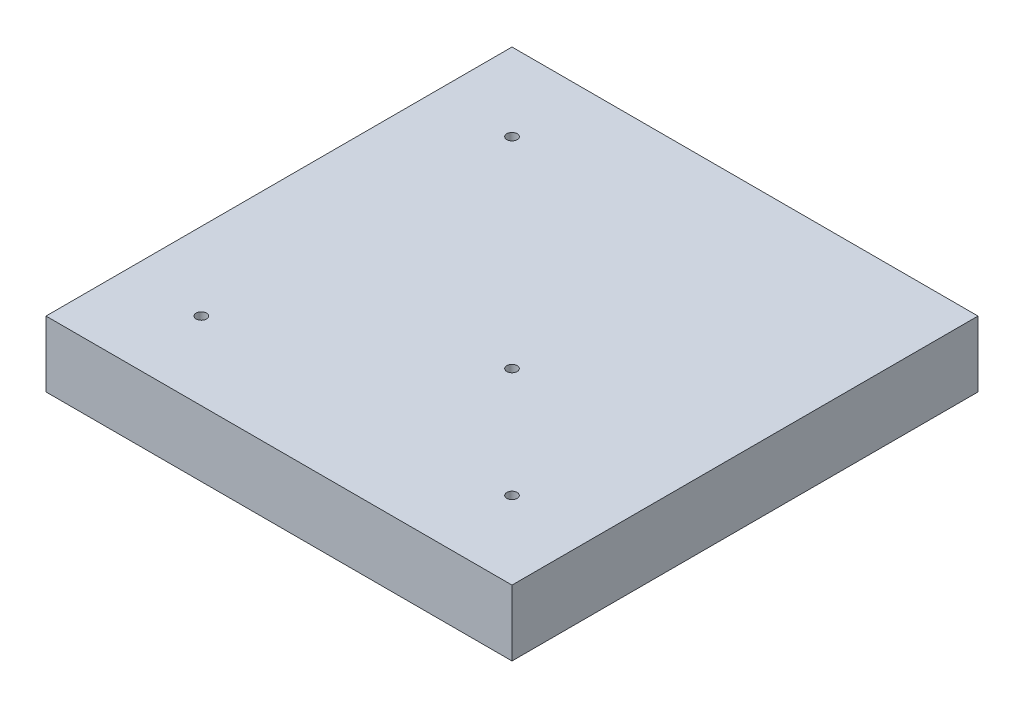
ISO-10303-21;
HEADER;
FILE_DESCRIPTION(('STEP AP214'),'2;1');
FILE_NAME('part.step','',(''),(''),'','','');
FILE_SCHEMA(('AUTOMOTIVE_DESIGN { 1 0 10303 214 1 1 1 1 }'));
ENDSEC;
DATA;
#1=APPLICATION_CONTEXT('core data for automotive mechanical design processes');
#2=APPLICATION_PROTOCOL_DEFINITION('international standard','automotive_design',2000,#1);
#3=PRODUCT_CONTEXT('',#1,'mechanical');
#4=PRODUCT('Part','Part','',(#3));
#5=PRODUCT_RELATED_PRODUCT_CATEGORY('part','',(#4));
#6=PRODUCT_DEFINITION_FORMATION('','',#4);
#7=PRODUCT_DEFINITION_CONTEXT('part definition',#1,'design');
#8=PRODUCT_DEFINITION('design','',#6,#7);
#9=PRODUCT_DEFINITION_SHAPE('','',#8);
#10=(LENGTH_UNIT() NAMED_UNIT(*) SI_UNIT(.MILLI.,.METRE.));
#11=(NAMED_UNIT(*) PLANE_ANGLE_UNIT() SI_UNIT($,.RADIAN.));
#12=(NAMED_UNIT(*) SI_UNIT($,.STERADIAN.) SOLID_ANGLE_UNIT());
#13=UNCERTAINTY_MEASURE_WITH_UNIT(LENGTH_MEASURE(1.E-05),#10,'distance_accuracy_value','');
#14=(GEOMETRIC_REPRESENTATION_CONTEXT(3) GLOBAL_UNCERTAINTY_ASSIGNED_CONTEXT((#13)) GLOBAL_UNIT_ASSIGNED_CONTEXT((#10,
#11,#12)) REPRESENTATION_CONTEXT('',''));
#15=CARTESIAN_POINT('',(0.,0.,0.));
#16=DIRECTION('',(0.,0.,1.));
#17=DIRECTION('',(1.,0.,0.));
#18=AXIS2_PLACEMENT_3D('',#15,#16,#17);
#19=CARTESIAN_POINT('',(0.,0.,0.));
#20=DIRECTION('',(0.,-1.,0.));
#21=DIRECTION('',(0.,0.,-1.));
#22=AXIS2_PLACEMENT_3D('',#19,#20,#21);
#23=PLANE('',#22);
#24=CARTESIAN_POINT('',(-30.,0.,30.));
#25=DIRECTION('',(0.,1.,0.));
#26=DIRECTION('',(0.,0.,1.));
#27=AXIS2_PLACEMENT_3D('',#24,#25,#26);
#28=CIRCLE('',#27,0.999999999999998);
#29=CARTESIAN_POINT('',(-30.,0.,31.));
#30=VERTEX_POINT('',#29);
#31=EDGE_CURVE('E120',#30,#30,#28,.T.);
#32=ORIENTED_EDGE('',*,*,#31,.T.);
#33=EDGE_LOOP('',(#32));
#34=FACE_BOUND('',#33,.T.);
#35=CARTESIAN_POINT('',(-30.,0.,-30.));
#36=DIRECTION('',(0.,1.,0.));
#37=DIRECTION('',(0.,0.,1.));
#38=AXIS2_PLACEMENT_3D('',#35,#36,#37);
#39=CIRCLE('',#38,0.999999999999998);
#40=CARTESIAN_POINT('',(-30.,0.,-29.));
#41=VERTEX_POINT('',#40);
#42=EDGE_CURVE('E108',#41,#41,#39,.T.);
#43=ORIENTED_EDGE('',*,*,#42,.T.);
#44=EDGE_LOOP('',(#43));
#45=FACE_BOUND('',#44,.T.);
#46=DIRECTION('',(0.,0.,-1.));
#47=VECTOR('',#46,1.);
#48=CARTESIAN_POINT('',(45.,0.,45.));
#49=LINE('',#48,#47);
#50=CARTESIAN_POINT('',(45.,0.,45.));
#51=VERTEX_POINT('',#50);
#52=CARTESIAN_POINT('',(45.,0.,-45.));
#53=VERTEX_POINT('',#52);
#54=EDGE_CURVE('E82',#51,#53,#49,.T.);
#55=ORIENTED_EDGE('',*,*,#54,.F.);
#56=DIRECTION('',(1.,0.,0.));
#57=VECTOR('',#56,1.);
#58=CARTESIAN_POINT('',(-45.,0.,45.));
#59=LINE('',#58,#57);
#60=CARTESIAN_POINT('',(-45.,0.,45.));
#61=VERTEX_POINT('',#60);
#62=EDGE_CURVE('E88',#61,#51,#59,.T.);
#63=ORIENTED_EDGE('',*,*,#62,.F.);
#64=DIRECTION('',(0.,0.,1.));
#65=VECTOR('',#64,1.);
#66=CARTESIAN_POINT('',(-45.,0.,45.));
#67=LINE('',#66,#65);
#68=CARTESIAN_POINT('',(-45.,0.,-45.));
#69=VERTEX_POINT('',#68);
#70=EDGE_CURVE('E105',#69,#61,#67,.T.);
#71=ORIENTED_EDGE('',*,*,#70,.F.);
#72=DIRECTION('',(-1.,0.,0.));
#73=VECTOR('',#72,1.);
#74=CARTESIAN_POINT('',(-45.,0.,-45.));
#75=LINE('',#74,#73);
#76=EDGE_CURVE('E95',#53,#69,#75,.T.);
#77=ORIENTED_EDGE('',*,*,#76,.F.);
#78=EDGE_LOOP('',(#55,#63,#71,#77));
#79=FACE_BOUND('',#78,.T.);
#80=CARTESIAN_POINT('',(30.,0.,30.));
#81=DIRECTION('',(0.,1.,0.));
#82=DIRECTION('',(0.,0.,1.));
#83=AXIS2_PLACEMENT_3D('',#80,#81,#82);
#84=CIRCLE('',#83,0.999999999999998);
#85=CARTESIAN_POINT('',(30.,0.,31.));
#86=VERTEX_POINT('',#85);
#87=EDGE_CURVE('E114',#86,#86,#84,.T.);
#88=ORIENTED_EDGE('',*,*,#87,.T.);
#89=EDGE_LOOP('',(#88));
#90=FACE_BOUND('',#89,.T.);
#91=CARTESIAN_POINT('',(8.78679656440357,0.,8.78679656440358));
#92=DIRECTION('',(0.,1.,0.));
#93=DIRECTION('',(0.,0.,1.));
#94=AXIS2_PLACEMENT_3D('',#91,#92,#93);
#95=CIRCLE('',#94,1.);
#96=CARTESIAN_POINT('',(8.78679656440357,0.,9.78679656440358));
#97=VERTEX_POINT('',#96);
#98=EDGE_CURVE('E126',#97,#97,#95,.T.);
#99=ORIENTED_EDGE('',*,*,#98,.T.);
#100=EDGE_LOOP('',(#99));
#101=FACE_BOUND('',#100,.T.);
#102=ADVANCED_FACE('F33',(#34,#45,#79,#90,#101),#23,.T.);
#103=CARTESIAN_POINT('',(0.,12.7,0.));
#104=DIRECTION('',(0.,1.,0.));
#105=DIRECTION('',(0.,0.,1.));
#106=AXIS2_PLACEMENT_3D('',#103,#104,#105);
#107=PLANE('',#106);
#108=CARTESIAN_POINT('',(-30.,12.7,30.));
#109=DIRECTION('',(0.,1.,0.));
#110=DIRECTION('',(0.,0.,1.));
#111=AXIS2_PLACEMENT_3D('',#108,#109,#110);
#112=CIRCLE('',#111,0.999999999999998);
#113=CARTESIAN_POINT('',(-30.,12.7,31.));
#114=VERTEX_POINT('',#113);
#115=EDGE_CURVE('E117',#114,#114,#112,.T.);
#116=ORIENTED_EDGE('',*,*,#115,.F.);
#117=EDGE_LOOP('',(#116));
#118=FACE_BOUND('',#117,.T.);
#119=CARTESIAN_POINT('',(-30.,12.7,-30.));
#120=DIRECTION('',(0.,1.,0.));
#121=DIRECTION('',(0.,0.,1.));
#122=AXIS2_PLACEMENT_3D('',#119,#120,#121);
#123=CIRCLE('',#122,0.999999999999998);
#124=CARTESIAN_POINT('',(-30.,12.7,-29.));
#125=VERTEX_POINT('',#124);
#126=EDGE_CURVE('E86',#125,#125,#123,.T.);
#127=ORIENTED_EDGE('',*,*,#126,.F.);
#128=EDGE_LOOP('',(#127));
#129=FACE_BOUND('',#128,.T.);
#130=DIRECTION('',(1.,0.,0.));
#131=VECTOR('',#130,1.);
#132=CARTESIAN_POINT('',(-45.,12.7,45.));
#133=LINE('',#132,#131);
#134=CARTESIAN_POINT('',(-45.,12.7,45.));
#135=VERTEX_POINT('',#134);
#136=CARTESIAN_POINT('',(45.,12.7,45.));
#137=VERTEX_POINT('',#136);
#138=EDGE_CURVE('E92',#135,#137,#133,.T.);
#139=ORIENTED_EDGE('',*,*,#138,.T.);
#140=DIRECTION('',(0.,0.,-1.));
#141=VECTOR('',#140,1.);
#142=CARTESIAN_POINT('',(45.,12.7,45.));
#143=LINE('',#142,#141);
#144=CARTESIAN_POINT('',(45.,12.7,-45.));
#145=VERTEX_POINT('',#144);
#146=EDGE_CURVE('E84',#137,#145,#143,.T.);
#147=ORIENTED_EDGE('',*,*,#146,.T.);
#148=DIRECTION('',(-1.,0.,0.));
#149=VECTOR('',#148,1.);
#150=CARTESIAN_POINT('',(-45.,12.7,-45.));
#151=LINE('',#150,#149);
#152=CARTESIAN_POINT('',(-45.,12.7,-45.));
#153=VERTEX_POINT('',#152);
#154=EDGE_CURVE('E42',#145,#153,#151,.T.);
#155=ORIENTED_EDGE('',*,*,#154,.T.);
#156=DIRECTION('',(0.,0.,1.));
#157=VECTOR('',#156,1.);
#158=CARTESIAN_POINT('',(-45.,12.7,45.));
#159=LINE('',#158,#157);
#160=EDGE_CURVE('E11',#153,#135,#159,.T.);
#161=ORIENTED_EDGE('',*,*,#160,.T.);
#162=EDGE_LOOP('',(#139,#147,#155,#161));
#163=FACE_BOUND('',#162,.T.);
#164=CARTESIAN_POINT('',(30.,12.7,30.));
#165=DIRECTION('',(0.,1.,0.));
#166=DIRECTION('',(0.,0.,1.));
#167=AXIS2_PLACEMENT_3D('',#164,#165,#166);
#168=CIRCLE('',#167,0.999999999999998);
#169=CARTESIAN_POINT('',(30.,12.7,31.));
#170=VERTEX_POINT('',#169);
#171=EDGE_CURVE('E111',#170,#170,#168,.T.);
#172=ORIENTED_EDGE('',*,*,#171,.F.);
#173=EDGE_LOOP('',(#172));
#174=FACE_BOUND('',#173,.T.);
#175=CARTESIAN_POINT('',(8.78679656440357,12.7,8.78679656440358));
#176=DIRECTION('',(0.,1.,0.));
#177=DIRECTION('',(0.,0.,1.));
#178=AXIS2_PLACEMENT_3D('',#175,#176,#177);
#179=CIRCLE('',#178,1.);
#180=CARTESIAN_POINT('',(8.78679656440357,12.7,9.78679656440358));
#181=VERTEX_POINT('',#180);
#182=EDGE_CURVE('E123',#181,#181,#179,.T.);
#183=ORIENTED_EDGE('',*,*,#182,.F.);
#184=EDGE_LOOP('',(#183));
#185=FACE_BOUND('',#184,.T.);
#186=ADVANCED_FACE('F35',(#118,#129,#163,#174,#185),#107,.T.);
#187=CARTESIAN_POINT('',(45.,139.979220613579,45.));
#188=DIRECTION('',(-1.,0.,0.));
#189=DIRECTION('',(0.,0.,1.));
#190=AXIS2_PLACEMENT_3D('',#187,#188,#189);
#191=PLANE('',#190);
#192=ORIENTED_EDGE('',*,*,#146,.F.);
#193=DIRECTION('',(0.,-1.,0.));
#194=VECTOR('',#193,1.);
#195=CARTESIAN_POINT('',(45.,139.979220613579,45.));
#196=LINE('',#195,#194);
#197=EDGE_CURVE('E37',#137,#51,#196,.T.);
#198=ORIENTED_EDGE('',*,*,#197,.T.);
#199=ORIENTED_EDGE('',*,*,#54,.T.);
#200=DIRECTION('',(0.,-1.,0.));
#201=VECTOR('',#200,1.);
#202=CARTESIAN_POINT('',(45.,139.979220613579,-45.));
#203=LINE('',#202,#201);
#204=EDGE_CURVE('E72',#145,#53,#203,.T.);
#205=ORIENTED_EDGE('',*,*,#204,.F.);
#206=EDGE_LOOP('',(#192,#198,#199,#205));
#207=FACE_BOUND('',#206,.T.);
#208=ADVANCED_FACE('F80',(#207),#191,.F.);
#209=CARTESIAN_POINT('',(-45.,139.979220613579,-45.));
#210=DIRECTION('',(0.,0.,1.));
#211=DIRECTION('',(1.,0.,0.));
#212=AXIS2_PLACEMENT_3D('',#209,#210,#211);
#213=PLANE('',#212);
#214=ORIENTED_EDGE('',*,*,#154,.F.);
#215=ORIENTED_EDGE('',*,*,#204,.T.);
#216=ORIENTED_EDGE('',*,*,#76,.T.);
#217=DIRECTION('',(0.,-1.,0.));
#218=VECTOR('',#217,1.);
#219=CARTESIAN_POINT('',(-45.,139.979220613579,-45.));
#220=LINE('',#219,#218);
#221=EDGE_CURVE('E104',#153,#69,#220,.T.);
#222=ORIENTED_EDGE('',*,*,#221,.F.);
#223=EDGE_LOOP('',(#214,#215,#216,#222));
#224=FACE_BOUND('',#223,.T.);
#225=ADVANCED_FACE('F141',(#224),#213,.F.);
#226=CARTESIAN_POINT('',(-45.,139.979220613579,45.));
#227=DIRECTION('',(1.,0.,0.));
#228=DIRECTION('',(0.,0.,-1.));
#229=AXIS2_PLACEMENT_3D('',#226,#227,#228);
#230=PLANE('',#229);
#231=ORIENTED_EDGE('',*,*,#160,.F.);
#232=ORIENTED_EDGE('',*,*,#221,.T.);
#233=ORIENTED_EDGE('',*,*,#70,.T.);
#234=DIRECTION('',(0.,-1.,0.));
#235=VECTOR('',#234,1.);
#236=CARTESIAN_POINT('',(-45.,139.979220613579,45.));
#237=LINE('',#236,#235);
#238=EDGE_CURVE('E55',#135,#61,#237,.T.);
#239=ORIENTED_EDGE('',*,*,#238,.F.);
#240=EDGE_LOOP('',(#231,#232,#233,#239));
#241=FACE_BOUND('',#240,.T.);
#242=ADVANCED_FACE('F173',(#241),#230,.F.);
#243=CARTESIAN_POINT('',(-45.,139.979220613579,45.));
#244=DIRECTION('',(0.,0.,-1.));
#245=DIRECTION('',(-1.,0.,0.));
#246=AXIS2_PLACEMENT_3D('',#243,#244,#245);
#247=PLANE('',#246);
#248=ORIENTED_EDGE('',*,*,#138,.F.);
#249=ORIENTED_EDGE('',*,*,#238,.T.);
#250=ORIENTED_EDGE('',*,*,#62,.T.);
#251=ORIENTED_EDGE('',*,*,#197,.F.);
#252=EDGE_LOOP('',(#248,#249,#250,#251));
#253=FACE_BOUND('',#252,.T.);
#254=ADVANCED_FACE('F89',(#253),#247,.F.);
#255=CARTESIAN_POINT('',(-30.,12.7,-30.));
#256=DIRECTION('',(0.,-1.,0.));
#257=DIRECTION('',(0.,0.,-1.));
#258=AXIS2_PLACEMENT_3D('',#255,#256,#257);
#259=CYLINDRICAL_SURFACE('',#258,0.999999999999998);
#260=ORIENTED_EDGE('',*,*,#126,.T.);
#261=EDGE_LOOP('',(#260));
#262=FACE_BOUND('',#261,.T.);
#263=ORIENTED_EDGE('',*,*,#42,.F.);
#264=EDGE_LOOP('',(#263));
#265=FACE_BOUND('',#264,.T.);
#266=ADVANCED_FACE('F155',(#262,#265),#259,.F.);
#267=CARTESIAN_POINT('',(30.,12.7,30.));
#268=DIRECTION('',(0.,-1.,0.));
#269=DIRECTION('',(0.,0.,-1.));
#270=AXIS2_PLACEMENT_3D('',#267,#268,#269);
#271=CYLINDRICAL_SURFACE('',#270,0.999999999999998);
#272=ORIENTED_EDGE('',*,*,#171,.T.);
#273=EDGE_LOOP('',(#272));
#274=FACE_BOUND('',#273,.T.);
#275=ORIENTED_EDGE('',*,*,#87,.F.);
#276=EDGE_LOOP('',(#275));
#277=FACE_BOUND('',#276,.T.);
#278=ADVANCED_FACE('F151',(#274,#277),#271,.F.);
#279=CARTESIAN_POINT('',(-30.,12.7,30.));
#280=DIRECTION('',(0.,-1.,0.));
#281=DIRECTION('',(0.,0.,-1.));
#282=AXIS2_PLACEMENT_3D('',#279,#280,#281);
#283=CYLINDRICAL_SURFACE('',#282,0.999999999999998);
#284=ORIENTED_EDGE('',*,*,#115,.T.);
#285=EDGE_LOOP('',(#284));
#286=FACE_BOUND('',#285,.T.);
#287=ORIENTED_EDGE('',*,*,#31,.F.);
#288=EDGE_LOOP('',(#287));
#289=FACE_BOUND('',#288,.T.);
#290=ADVANCED_FACE('F154',(#286,#289),#283,.F.);
#291=CARTESIAN_POINT('',(8.78679656440357,12.7,8.78679656440358));
#292=DIRECTION('',(0.,-1.,0.));
#293=DIRECTION('',(0.,0.,-1.));
#294=AXIS2_PLACEMENT_3D('',#291,#292,#293);
#295=CYLINDRICAL_SURFACE('',#294,1.);
#296=ORIENTED_EDGE('',*,*,#182,.T.);
#297=EDGE_LOOP('',(#296));
#298=FACE_BOUND('',#297,.T.);
#299=ORIENTED_EDGE('',*,*,#98,.F.);
#300=EDGE_LOOP('',(#299));
#301=FACE_BOUND('',#300,.T.);
#302=ADVANCED_FACE('F132',(#298,#301),#295,.F.);
#303=CLOSED_SHELL('',(#102,#186,#208,#225,#242,#254,#266,#278,#290,#302));
#304=MANIFOLD_SOLID_BREP('B2',#303);
#305=ADVANCED_BREP_SHAPE_REPRESENTATION('',(#18,#304),#14);
#306=SHAPE_DEFINITION_REPRESENTATION(#9,#305);
ENDSEC;
END-ISO-10303-21;
